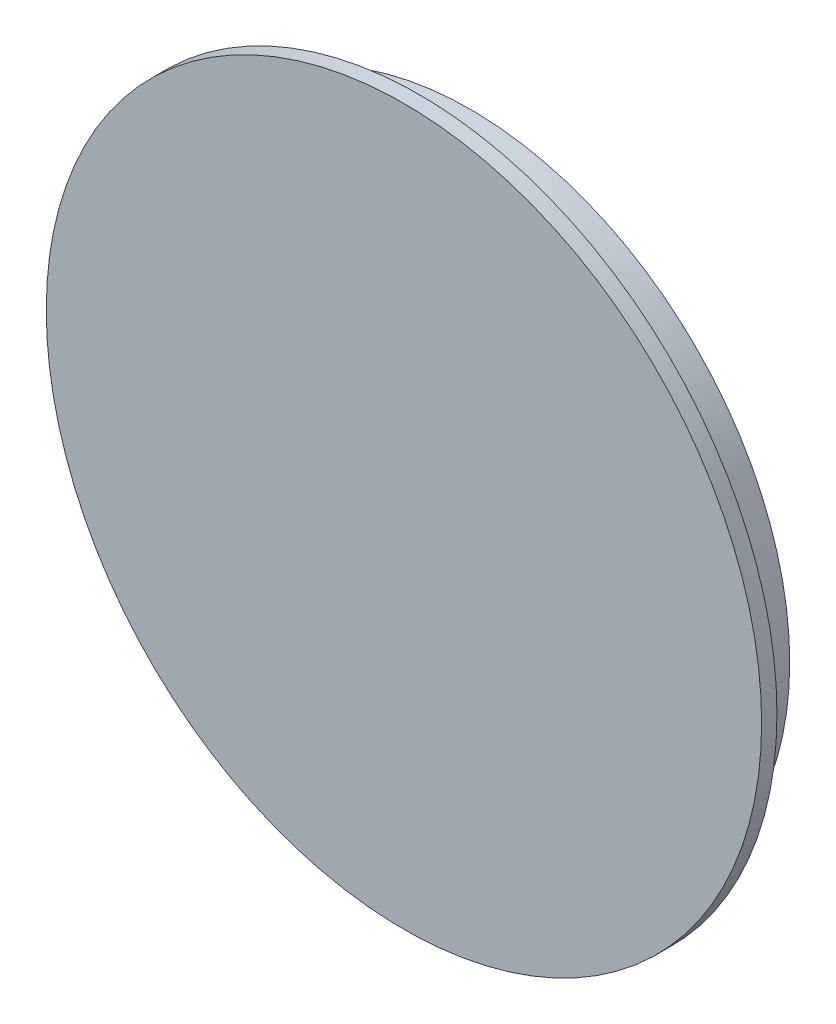
ISO-10303-21;
HEADER;
FILE_DESCRIPTION(('STEP AP214'),'2;1');
FILE_NAME('part.step','',(''),(''),'','','');
FILE_SCHEMA(('AUTOMOTIVE_DESIGN { 1 0 10303 214 1 1 1 1 }'));
ENDSEC;
DATA;
#1=APPLICATION_CONTEXT('core data for automotive mechanical design processes');
#2=APPLICATION_PROTOCOL_DEFINITION('international standard','automotive_design',2000,#1);
#3=PRODUCT_CONTEXT('',#1,'mechanical');
#4=PRODUCT('Part','Part','',(#3));
#5=PRODUCT_RELATED_PRODUCT_CATEGORY('part','',(#4));
#6=PRODUCT_DEFINITION_FORMATION('','',#4);
#7=PRODUCT_DEFINITION_CONTEXT('part definition',#1,'design');
#8=PRODUCT_DEFINITION('design','',#6,#7);
#9=PRODUCT_DEFINITION_SHAPE('','',#8);
#10=(LENGTH_UNIT() NAMED_UNIT(*) SI_UNIT(.MILLI.,.METRE.));
#11=(NAMED_UNIT(*) PLANE_ANGLE_UNIT() SI_UNIT($,.RADIAN.));
#12=(NAMED_UNIT(*) SI_UNIT($,.STERADIAN.) SOLID_ANGLE_UNIT());
#13=UNCERTAINTY_MEASURE_WITH_UNIT(LENGTH_MEASURE(1.E-05),#10,'distance_accuracy_value','');
#14=(GEOMETRIC_REPRESENTATION_CONTEXT(3) GLOBAL_UNCERTAINTY_ASSIGNED_CONTEXT((#13)) GLOBAL_UNIT_ASSIGNED_CONTEXT((#10,
#11,#12)) REPRESENTATION_CONTEXT('',''));
#15=CARTESIAN_POINT('',(0.,0.,0.));
#16=DIRECTION('',(0.,0.,1.));
#17=DIRECTION('',(1.,0.,0.));
#18=AXIS2_PLACEMENT_3D('',#15,#16,#17);
#19=CARTESIAN_POINT('',(0.,0.,-16.51));
#20=DIRECTION('',(0.,0.,-1.));
#21=DIRECTION('',(-1.,0.,0.));
#22=AXIS2_PLACEMENT_3D('',#19,#20,#21);
#23=PLANE('',#22);
#24=CARTESIAN_POINT('',(0.,0.,-16.51));
#25=DIRECTION('',(0.,0.,1.));
#26=DIRECTION('',(1.,0.,0.));
#27=AXIS2_PLACEMENT_3D('',#24,#25,#26);
#28=CIRCLE('',#27,69.85);
#29=CARTESIAN_POINT('',(69.85,0.,-16.51));
#30=VERTEX_POINT('',#29);
#31=EDGE_CURVE('E67',#30,#30,#28,.T.);
#32=ORIENTED_EDGE('',*,*,#31,.T.);
#33=EDGE_LOOP('',(#32));
#34=FACE_BOUND('',#33,.T.);
#35=CARTESIAN_POINT('',(0.,0.,-16.51));
#36=DIRECTION('',(0.,0.,1.));
#37=DIRECTION('',(1.,0.,0.));
#38=AXIS2_PLACEMENT_3D('',#35,#36,#37);
#39=CIRCLE('',#38,73.025);
#40=CARTESIAN_POINT('',(73.025,0.,-16.51));
#41=VERTEX_POINT('',#40);
#42=EDGE_CURVE('E10',#41,#41,#39,.T.);
#43=ORIENTED_EDGE('',*,*,#42,.F.);
#44=EDGE_LOOP('',(#43));
#45=FACE_BOUND('',#44,.T.);
#46=ADVANCED_FACE('F33',(#34,#45),#23,.T.);
#47=CARTESIAN_POINT('',(0.,0.,0.));
#48=DIRECTION('',(0.,0.,1.));
#49=DIRECTION('',(1.,0.,0.));
#50=AXIS2_PLACEMENT_3D('',#47,#48,#49);
#51=CYLINDRICAL_SURFACE('',#50,73.025);
#52=ORIENTED_EDGE('',*,*,#42,.T.);
#53=EDGE_LOOP('',(#52));
#54=FACE_BOUND('',#53,.T.);
#55=CARTESIAN_POINT('',(0.,0.,-6.34999999999999));
#56=DIRECTION('',(0.,0.,1.));
#57=DIRECTION('',(1.,0.,0.));
#58=AXIS2_PLACEMENT_3D('',#55,#56,#57);
#59=CIRCLE('',#58,73.025);
#60=CARTESIAN_POINT('',(73.025,0.,-6.34999999999999));
#61=VERTEX_POINT('',#60);
#62=EDGE_CURVE('E39',#61,#61,#59,.T.);
#63=ORIENTED_EDGE('',*,*,#62,.F.);
#64=EDGE_LOOP('',(#63));
#65=FACE_BOUND('',#64,.T.);
#66=ADVANCED_FACE('F85',(#54,#65),#51,.T.);
#67=CARTESIAN_POINT('',(0.,0.,-6.34999999999999));
#68=DIRECTION('',(0.,0.,-1.));
#69=DIRECTION('',(-1.,0.,0.));
#70=AXIS2_PLACEMENT_3D('',#67,#68,#69);
#71=PLANE('',#70);
#72=ORIENTED_EDGE('',*,*,#62,.T.);
#73=EDGE_LOOP('',(#72));
#74=FACE_BOUND('',#73,.T.);
#75=CARTESIAN_POINT('',(0.,0.,-6.34999999999999));
#76=DIRECTION('',(0.,0.,1.));
#77=DIRECTION('',(1.,0.,0.));
#78=AXIS2_PLACEMENT_3D('',#75,#76,#77);
#79=CIRCLE('',#78,76.2);
#80=CARTESIAN_POINT('',(76.2,0.,-6.34999999999999));
#81=VERTEX_POINT('',#80);
#82=EDGE_CURVE('E43',#81,#81,#79,.T.);
#83=ORIENTED_EDGE('',*,*,#82,.F.);
#84=EDGE_LOOP('',(#83));
#85=FACE_BOUND('',#84,.T.);
#86=ADVANCED_FACE('F89',(#74,#85),#71,.T.);
#87=CARTESIAN_POINT('',(0.,0.,0.));
#88=DIRECTION('',(0.,0.,1.));
#89=DIRECTION('',(1.,0.,0.));
#90=AXIS2_PLACEMENT_3D('',#87,#88,#89);
#91=CYLINDRICAL_SURFACE('',#90,76.2);
#92=ORIENTED_EDGE('',*,*,#82,.T.);
#93=EDGE_LOOP('',(#92));
#94=FACE_BOUND('',#93,.T.);
#95=CARTESIAN_POINT('',(0.,0.,-16.51));
#96=DIRECTION('',(0.,0.,1.));
#97=DIRECTION('',(1.,0.,0.));
#98=AXIS2_PLACEMENT_3D('',#95,#96,#97);
#99=CIRCLE('',#98,76.2);
#100=CARTESIAN_POINT('',(76.2,0.,-16.51));
#101=VERTEX_POINT('',#100);
#102=EDGE_CURVE('E47',#101,#101,#99,.T.);
#103=ORIENTED_EDGE('',*,*,#102,.F.);
#104=EDGE_LOOP('',(#103));
#105=FACE_BOUND('',#104,.T.);
#106=ADVANCED_FACE('F93',(#94,#105),#91,.F.);
#107=CARTESIAN_POINT('',(0.,0.,-16.51));
#108=DIRECTION('',(0.,0.,-1.));
#109=DIRECTION('',(-1.,0.,0.));
#110=AXIS2_PLACEMENT_3D('',#107,#108,#109);
#111=PLANE('',#110);
#112=ORIENTED_EDGE('',*,*,#102,.T.);
#113=EDGE_LOOP('',(#112));
#114=FACE_BOUND('',#113,.T.);
#115=CARTESIAN_POINT('',(0.,0.,-16.51));
#116=DIRECTION('',(0.,0.,1.));
#117=DIRECTION('',(1.,0.,0.));
#118=AXIS2_PLACEMENT_3D('',#115,#116,#117);
#119=CIRCLE('',#118,79.375);
#120=CARTESIAN_POINT('',(79.375,0.,-16.51));
#121=VERTEX_POINT('',#120);
#122=EDGE_CURVE('E52',#121,#121,#119,.T.);
#123=ORIENTED_EDGE('',*,*,#122,.F.);
#124=EDGE_LOOP('',(#123));
#125=FACE_BOUND('',#124,.T.);
#126=ADVANCED_FACE('F99',(#114,#125),#111,.T.);
#127=CARTESIAN_POINT('',(0.,0.,0.));
#128=DIRECTION('',(0.,0.,1.));
#129=DIRECTION('',(1.,0.,0.));
#130=AXIS2_PLACEMENT_3D('',#127,#128,#129);
#131=CYLINDRICAL_SURFACE('',#130,79.375);
#132=ORIENTED_EDGE('',*,*,#122,.T.);
#133=EDGE_LOOP('',(#132));
#134=FACE_BOUND('',#133,.T.);
#135=CARTESIAN_POINT('',(0.,0.,-3.80999999999999));
#136=DIRECTION('',(0.,0.,1.));
#137=DIRECTION('',(1.,0.,0.));
#138=AXIS2_PLACEMENT_3D('',#135,#136,#137);
#139=CIRCLE('',#138,79.375);
#140=CARTESIAN_POINT('',(79.375,0.,-3.80999999999999));
#141=VERTEX_POINT('',#140);
#142=EDGE_CURVE('E55',#141,#141,#139,.T.);
#143=ORIENTED_EDGE('',*,*,#142,.F.);
#144=EDGE_LOOP('',(#143));
#145=FACE_BOUND('',#144,.T.);
#146=ADVANCED_FACE('F103',(#134,#145),#131,.T.);
#147=CARTESIAN_POINT('',(0.,0.,-3.80999999999999));
#148=DIRECTION('',(0.,0.,-1.));
#149=DIRECTION('',(-1.,0.,0.));
#150=AXIS2_PLACEMENT_3D('',#147,#148,#149);
#151=PLANE('',#150);
#152=ORIENTED_EDGE('',*,*,#142,.T.);
#153=EDGE_LOOP('',(#152));
#154=FACE_BOUND('',#153,.T.);
#155=CARTESIAN_POINT('',(0.,0.,-3.80999999999999));
#156=DIRECTION('',(0.,0.,1.));
#157=DIRECTION('',(1.,0.,0.));
#158=AXIS2_PLACEMENT_3D('',#155,#156,#157);
#159=CIRCLE('',#158,88.9);
#160=CARTESIAN_POINT('',(88.9,0.,-3.80999999999999));
#161=VERTEX_POINT('',#160);
#162=EDGE_CURVE('E58',#161,#161,#159,.T.);
#163=ORIENTED_EDGE('',*,*,#162,.F.);
#164=EDGE_LOOP('',(#163));
#165=FACE_BOUND('',#164,.T.);
#166=ADVANCED_FACE('F107',(#154,#165),#151,.T.);
#167=CARTESIAN_POINT('',(0.,0.,0.));
#168=DIRECTION('',(0.,0.,1.));
#169=DIRECTION('',(1.,0.,0.));
#170=AXIS2_PLACEMENT_3D('',#167,#168,#169);
#171=CYLINDRICAL_SURFACE('',#170,88.9);
#172=ORIENTED_EDGE('',*,*,#162,.T.);
#173=EDGE_LOOP('',(#172));
#174=FACE_BOUND('',#173,.T.);
#175=CARTESIAN_POINT('',(0.,0.,0.));
#176=DIRECTION('',(0.,0.,1.));
#177=DIRECTION('',(1.,0.,0.));
#178=AXIS2_PLACEMENT_3D('',#175,#176,#177);
#179=CIRCLE('',#178,88.9);
#180=CARTESIAN_POINT('',(88.9,0.,0.));
#181=VERTEX_POINT('',#180);
#182=EDGE_CURVE('E61',#181,#181,#179,.T.);
#183=ORIENTED_EDGE('',*,*,#182,.F.);
#184=EDGE_LOOP('',(#183));
#185=FACE_BOUND('',#184,.T.);
#186=ADVANCED_FACE('F111',(#174,#185),#171,.T.);
#187=CARTESIAN_POINT('',(0.,0.,0.));
#188=DIRECTION('',(0.,0.,1.));
#189=DIRECTION('',(1.,0.,0.));
#190=AXIS2_PLACEMENT_3D('',#187,#188,#189);
#191=PLANE('',#190);
#192=ORIENTED_EDGE('',*,*,#182,.T.);
#193=EDGE_LOOP('',(#192));
#194=FACE_BOUND('',#193,.T.);
#195=ADVANCED_FACE('F81',(#194),#191,.T.);
#196=CARTESIAN_POINT('',(0.,0.,-3.80999999999999));
#197=DIRECTION('',(0.,0.,-1.));
#198=DIRECTION('',(-1.,0.,0.));
#199=AXIS2_PLACEMENT_3D('',#196,#197,#198);
#200=PLANE('',#199);
#201=CARTESIAN_POINT('',(0.,0.,-3.80999999999999));
#202=DIRECTION('',(0.,0.,1.));
#203=DIRECTION('',(1.,0.,0.));
#204=AXIS2_PLACEMENT_3D('',#201,#202,#203);
#205=CIRCLE('',#204,69.85);
#206=CARTESIAN_POINT('',(69.85,0.,-3.80999999999999));
#207=VERTEX_POINT('',#206);
#208=EDGE_CURVE('E64',#207,#207,#205,.T.);
#209=ORIENTED_EDGE('',*,*,#208,.F.);
#210=EDGE_LOOP('',(#209));
#211=FACE_BOUND('',#210,.T.);
#212=ADVANCED_FACE('F75',(#211),#200,.T.);
#213=CARTESIAN_POINT('',(0.,0.,0.));
#214=DIRECTION('',(0.,0.,1.));
#215=DIRECTION('',(1.,0.,0.));
#216=AXIS2_PLACEMENT_3D('',#213,#214,#215);
#217=CYLINDRICAL_SURFACE('',#216,69.85);
#218=ORIENTED_EDGE('',*,*,#208,.T.);
#219=EDGE_LOOP('',(#218));
#220=FACE_BOUND('',#219,.T.);
#221=ORIENTED_EDGE('',*,*,#31,.F.);
#222=EDGE_LOOP('',(#221));
#223=FACE_BOUND('',#222,.T.);
#224=ADVANCED_FACE('F73',(#220,#223),#217,.F.);
#225=CLOSED_SHELL('',(#46,#66,#86,#106,#126,#146,#166,#186,#195,#212,#224));
#226=MANIFOLD_SOLID_BREP('B2',#225);
#227=ADVANCED_BREP_SHAPE_REPRESENTATION('',(#18,#226),#14);
#228=SHAPE_DEFINITION_REPRESENTATION(#9,#227);
ENDSEC;
END-ISO-10303-21;
